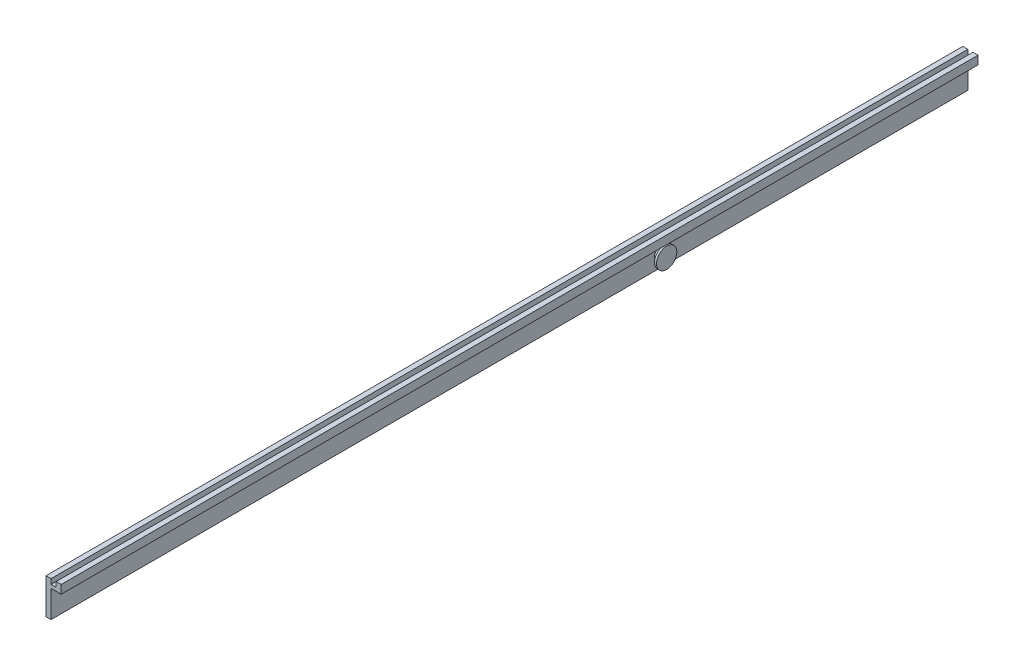
ISO-10303-21;
HEADER;
FILE_DESCRIPTION(('STEP AP214'),'2;1');
FILE_NAME('part.step','',(''),(''),'','','');
FILE_SCHEMA(('AUTOMOTIVE_DESIGN { 1 0 10303 214 1 1 1 1 }'));
ENDSEC;
DATA;
#1=APPLICATION_CONTEXT('core data for automotive mechanical design processes');
#2=APPLICATION_PROTOCOL_DEFINITION('international standard','automotive_design',2000,#1);
#3=PRODUCT_CONTEXT('',#1,'mechanical');
#4=PRODUCT('Part','Part','',(#3));
#5=PRODUCT_RELATED_PRODUCT_CATEGORY('part','',(#4));
#6=PRODUCT_DEFINITION_FORMATION('','',#4);
#7=PRODUCT_DEFINITION_CONTEXT('part definition',#1,'design');
#8=PRODUCT_DEFINITION('design','',#6,#7);
#9=PRODUCT_DEFINITION_SHAPE('','',#8);
#10=(LENGTH_UNIT() NAMED_UNIT(*) SI_UNIT(.MILLI.,.METRE.));
#11=(NAMED_UNIT(*) PLANE_ANGLE_UNIT() SI_UNIT($,.RADIAN.));
#12=(NAMED_UNIT(*) SI_UNIT($,.STERADIAN.) SOLID_ANGLE_UNIT());
#13=UNCERTAINTY_MEASURE_WITH_UNIT(LENGTH_MEASURE(1.E-05),#10,'distance_accuracy_value','');
#14=(GEOMETRIC_REPRESENTATION_CONTEXT(3) GLOBAL_UNCERTAINTY_ASSIGNED_CONTEXT((#13)) GLOBAL_UNIT_ASSIGNED_CONTEXT((#10,
#11,#12)) REPRESENTATION_CONTEXT('',''));
#15=CARTESIAN_POINT('',(0.,0.,0.));
#16=DIRECTION('',(0.,0.,1.));
#17=DIRECTION('',(1.,0.,0.));
#18=AXIS2_PLACEMENT_3D('',#15,#16,#17);
#19=CARTESIAN_POINT('',(20.,0.,904.));
#20=DIRECTION('',(0.,1.,0.));
#21=DIRECTION('',(0.,0.,1.));
#22=AXIS2_PLACEMENT_3D('',#19,#20,#21);
#23=PLANE('',#22);
#24=DIRECTION('',(0.,0.,1.));
#25=VECTOR('',#24,1.);
#26=CARTESIAN_POINT('',(10.,0.,0.));
#27=LINE('',#26,#25);
#28=CARTESIAN_POINT('',(10.,0.,0.));
#29=VERTEX_POINT('',#28);
#30=CARTESIAN_POINT('',(10.,0.,904.));
#31=VERTEX_POINT('',#30);
#32=EDGE_CURVE('E189',#29,#31,#27,.T.);
#33=ORIENTED_EDGE('',*,*,#32,.T.);
#34=DIRECTION('',(-1.,0.,0.));
#35=VECTOR('',#34,1.);
#36=CARTESIAN_POINT('',(20.,0.,904.));
#37=LINE('',#36,#35);
#38=CARTESIAN_POINT('',(5.,0.,904.));
#39=VERTEX_POINT('',#38);
#40=EDGE_CURVE('E187',#31,#39,#37,.T.);
#41=ORIENTED_EDGE('',*,*,#40,.T.);
#42=DIRECTION('',(0.,0.,-1.));
#43=VECTOR('',#42,1.);
#44=CARTESIAN_POINT('',(5.,0.,904.));
#45=LINE('',#44,#43);
#46=CARTESIAN_POINT('',(5.,0.,0.));
#47=VERTEX_POINT('',#46);
#48=EDGE_CURVE('E11',#39,#47,#45,.T.);
#49=ORIENTED_EDGE('',*,*,#48,.T.);
#50=DIRECTION('',(-1.,0.,0.));
#51=VECTOR('',#50,1.);
#52=CARTESIAN_POINT('',(20.,0.,0.));
#53=LINE('',#52,#51);
#54=EDGE_CURVE('E148',#29,#47,#53,.T.);
#55=ORIENTED_EDGE('',*,*,#54,.F.);
#56=EDGE_LOOP('',(#33,#41,#49,#55));
#57=FACE_BOUND('',#56,.T.);
#58=ADVANCED_FACE('F41',(#57),#23,.F.);
#59=CARTESIAN_POINT('',(20.,0.,904.));
#60=DIRECTION('',(-1.,0.,0.));
#61=DIRECTION('',(0.,0.,-1.));
#62=AXIS2_PLACEMENT_3D('',#59,#60,#61);
#63=PLANE('',#62);
#64=DIRECTION('',(0.,-1.,0.));
#65=VECTOR('',#64,1.);
#66=CARTESIAN_POINT('',(20.,0.,0.));
#67=LINE('',#66,#65);
#68=CARTESIAN_POINT('',(20.,35.,0.));
#69=VERTEX_POINT('',#68);
#70=CARTESIAN_POINT('',(20.,26.6744169741884,0.));
#71=VERTEX_POINT('',#70);
#72=EDGE_CURVE('E146',#69,#71,#67,.T.);
#73=ORIENTED_EDGE('',*,*,#72,.F.);
#74=DIRECTION('',(0.,0.,-1.));
#75=VECTOR('',#74,1.);
#76=CARTESIAN_POINT('',(20.,35.,904.));
#77=LINE('',#76,#75);
#78=CARTESIAN_POINT('',(20.,35.,904.));
#79=VERTEX_POINT('',#78);
#80=EDGE_CURVE('E145',#79,#69,#77,.T.);
#81=ORIENTED_EDGE('',*,*,#80,.F.);
#82=DIRECTION('',(0.,-1.,0.));
#83=VECTOR('',#82,1.);
#84=CARTESIAN_POINT('',(20.,0.,904.));
#85=LINE('',#84,#83);
#86=CARTESIAN_POINT('',(20.,26.6744169741884,904.));
#87=VERTEX_POINT('',#86);
#88=EDGE_CURVE('E165',#79,#87,#85,.T.);
#89=ORIENTED_EDGE('',*,*,#88,.T.);
#90=DIRECTION('',(0.,0.,-1.));
#91=VECTOR('',#90,1.);
#92=CARTESIAN_POINT('',(20.,26.6744169741884,0.));
#93=LINE('',#92,#91);
#94=EDGE_CURVE('E386',#87,#71,#93,.T.);
#95=ORIENTED_EDGE('',*,*,#94,.T.);
#96=EDGE_LOOP('',(#73,#81,#89,#95));
#97=FACE_BOUND('',#96,.T.);
#98=ADVANCED_FACE('F43',(#97),#63,.F.);
#99=CARTESIAN_POINT('',(5.,0.,904.));
#100=DIRECTION('',(1.,0.,0.));
#101=DIRECTION('',(0.,0.,1.));
#102=AXIS2_PLACEMENT_3D('',#99,#100,#101);
#103=PLANE('',#102);
#104=DIRECTION('',(0.,1.,0.));
#105=VECTOR('',#104,1.);
#106=CARTESIAN_POINT('',(5.,0.,0.));
#107=LINE('',#106,#105);
#108=CARTESIAN_POINT('',(5.,35.,0.));
#109=VERTEX_POINT('',#108);
#110=EDGE_CURVE('E152',#47,#109,#107,.T.);
#111=ORIENTED_EDGE('',*,*,#110,.F.);
#112=ORIENTED_EDGE('',*,*,#48,.F.);
#113=DIRECTION('',(0.,1.,0.));
#114=VECTOR('',#113,1.);
#115=CARTESIAN_POINT('',(5.,0.,904.));
#116=LINE('',#115,#114);
#117=CARTESIAN_POINT('',(5.,35.,904.));
#118=VERTEX_POINT('',#117);
#119=EDGE_CURVE('E103',#39,#118,#116,.T.);
#120=ORIENTED_EDGE('',*,*,#119,.T.);
#121=DIRECTION('',(0.,0.,-1.));
#122=VECTOR('',#121,1.);
#123=CARTESIAN_POINT('',(5.,35.,904.));
#124=LINE('',#123,#122);
#125=EDGE_CURVE('E49',#118,#109,#124,.T.);
#126=ORIENTED_EDGE('',*,*,#125,.T.);
#127=EDGE_LOOP('',(#111,#112,#120,#126));
#128=FACE_BOUND('',#127,.T.);
#129=ADVANCED_FACE('F174',(#128),#103,.F.);
#130=CARTESIAN_POINT('',(10.,35.,904.));
#131=DIRECTION('',(0.,-1.,0.));
#132=DIRECTION('',(0.,0.,-1.));
#133=AXIS2_PLACEMENT_3D('',#130,#131,#132);
#134=PLANE('',#133);
#135=DIRECTION('',(1.,0.,0.));
#136=VECTOR('',#135,1.);
#137=CARTESIAN_POINT('',(10.,35.,0.));
#138=LINE('',#137,#136);
#139=CARTESIAN_POINT('',(10.,35.,0.));
#140=VERTEX_POINT('',#139);
#141=EDGE_CURVE('E155',#109,#140,#138,.T.);
#142=ORIENTED_EDGE('',*,*,#141,.F.);
#143=ORIENTED_EDGE('',*,*,#125,.F.);
#144=DIRECTION('',(1.,0.,0.));
#145=VECTOR('',#144,1.);
#146=CARTESIAN_POINT('',(10.,35.,904.));
#147=LINE('',#146,#145);
#148=CARTESIAN_POINT('',(10.,35.,904.));
#149=VERTEX_POINT('',#148);
#150=EDGE_CURVE('E140',#118,#149,#147,.T.);
#151=ORIENTED_EDGE('',*,*,#150,.T.);
#152=DIRECTION('',(0.,0.,-1.));
#153=VECTOR('',#152,1.);
#154=CARTESIAN_POINT('',(10.,35.,904.));
#155=LINE('',#154,#153);
#156=EDGE_CURVE('E169',#149,#140,#155,.T.);
#157=ORIENTED_EDGE('',*,*,#156,.T.);
#158=EDGE_LOOP('',(#142,#143,#151,#157));
#159=FACE_BOUND('',#158,.T.);
#160=ADVANCED_FACE('F196',(#159),#134,.F.);
#161=CARTESIAN_POINT('',(10.,30.,904.));
#162=DIRECTION('',(-1.,0.,0.));
#163=DIRECTION('',(0.,0.,-1.));
#164=AXIS2_PLACEMENT_3D('',#161,#162,#163);
#165=PLANE('',#164);
#166=DIRECTION('',(0.,-1.,0.));
#167=VECTOR('',#166,1.);
#168=CARTESIAN_POINT('',(10.,30.,0.));
#169=LINE('',#168,#167);
#170=CARTESIAN_POINT('',(10.,30.,0.));
#171=VERTEX_POINT('',#170);
#172=EDGE_CURVE('E158',#140,#171,#169,.T.);
#173=ORIENTED_EDGE('',*,*,#172,.F.);
#174=ORIENTED_EDGE('',*,*,#156,.F.);
#175=DIRECTION('',(0.,-1.,0.));
#176=VECTOR('',#175,1.);
#177=CARTESIAN_POINT('',(10.,30.,904.));
#178=LINE('',#177,#176);
#179=CARTESIAN_POINT('',(10.,30.,904.));
#180=VERTEX_POINT('',#179);
#181=EDGE_CURVE('E138',#149,#180,#178,.T.);
#182=ORIENTED_EDGE('',*,*,#181,.T.);
#183=DIRECTION('',(0.,0.,-1.));
#184=VECTOR('',#183,1.);
#185=CARTESIAN_POINT('',(10.,30.,904.));
#186=LINE('',#185,#184);
#187=EDGE_CURVE('E132',#180,#171,#186,.T.);
#188=ORIENTED_EDGE('',*,*,#187,.T.);
#189=EDGE_LOOP('',(#173,#174,#182,#188));
#190=FACE_BOUND('',#189,.T.);
#191=ADVANCED_FACE('F199',(#190),#165,.F.);
#192=CARTESIAN_POINT('',(15.,30.,904.));
#193=DIRECTION('',(0.,-1.,0.));
#194=DIRECTION('',(0.,0.,-1.));
#195=AXIS2_PLACEMENT_3D('',#192,#193,#194);
#196=PLANE('',#195);
#197=DIRECTION('',(1.,0.,0.));
#198=VECTOR('',#197,1.);
#199=CARTESIAN_POINT('',(15.,30.,0.));
#200=LINE('',#199,#198);
#201=CARTESIAN_POINT('',(15.,30.,0.));
#202=VERTEX_POINT('',#201);
#203=EDGE_CURVE('E161',#171,#202,#200,.T.);
#204=ORIENTED_EDGE('',*,*,#203,.F.);
#205=ORIENTED_EDGE('',*,*,#187,.F.);
#206=DIRECTION('',(1.,0.,0.));
#207=VECTOR('',#206,1.);
#208=CARTESIAN_POINT('',(15.,30.,904.));
#209=LINE('',#208,#207);
#210=CARTESIAN_POINT('',(15.,30.,904.));
#211=VERTEX_POINT('',#210);
#212=EDGE_CURVE('E121',#180,#211,#209,.T.);
#213=ORIENTED_EDGE('',*,*,#212,.T.);
#214=DIRECTION('',(0.,0.,-1.));
#215=VECTOR('',#214,1.);
#216=CARTESIAN_POINT('',(15.,30.,904.));
#217=LINE('',#216,#215);
#218=EDGE_CURVE('E127',#211,#202,#217,.T.);
#219=ORIENTED_EDGE('',*,*,#218,.T.);
#220=EDGE_LOOP('',(#204,#205,#213,#219));
#221=FACE_BOUND('',#220,.T.);
#222=ADVANCED_FACE('F135',(#221),#196,.F.);
#223=CARTESIAN_POINT('',(15.,35.,904.));
#224=DIRECTION('',(1.,0.,0.));
#225=DIRECTION('',(0.,0.,1.));
#226=AXIS2_PLACEMENT_3D('',#223,#224,#225);
#227=PLANE('',#226);
#228=DIRECTION('',(0.,1.,0.));
#229=VECTOR('',#228,1.);
#230=CARTESIAN_POINT('',(15.,35.,0.));
#231=LINE('',#230,#229);
#232=CARTESIAN_POINT('',(15.,35.,0.));
#233=VERTEX_POINT('',#232);
#234=EDGE_CURVE('E129',#202,#233,#231,.T.);
#235=ORIENTED_EDGE('',*,*,#234,.F.);
#236=ORIENTED_EDGE('',*,*,#218,.F.);
#237=DIRECTION('',(0.,1.,0.));
#238=VECTOR('',#237,1.);
#239=CARTESIAN_POINT('',(15.,35.,904.));
#240=LINE('',#239,#238);
#241=CARTESIAN_POINT('',(15.,35.,904.));
#242=VERTEX_POINT('',#241);
#243=EDGE_CURVE('E117',#211,#242,#240,.T.);
#244=ORIENTED_EDGE('',*,*,#243,.T.);
#245=DIRECTION('',(0.,0.,-1.));
#246=VECTOR('',#245,1.);
#247=CARTESIAN_POINT('',(15.,35.,904.));
#248=LINE('',#247,#246);
#249=EDGE_CURVE('E133',#242,#233,#248,.T.);
#250=ORIENTED_EDGE('',*,*,#249,.T.);
#251=EDGE_LOOP('',(#235,#236,#244,#250));
#252=FACE_BOUND('',#251,.T.);
#253=ADVANCED_FACE('F128',(#252),#227,.F.);
#254=CARTESIAN_POINT('',(20.,35.,904.));
#255=DIRECTION('',(0.,-1.,0.));
#256=DIRECTION('',(0.,0.,-1.));
#257=AXIS2_PLACEMENT_3D('',#254,#255,#256);
#258=PLANE('',#257);
#259=DIRECTION('',(1.,0.,0.));
#260=VECTOR('',#259,1.);
#261=CARTESIAN_POINT('',(20.,35.,0.));
#262=LINE('',#261,#260);
#263=EDGE_CURVE('E95',#233,#69,#262,.T.);
#264=ORIENTED_EDGE('',*,*,#263,.F.);
#265=ORIENTED_EDGE('',*,*,#249,.F.);
#266=DIRECTION('',(1.,0.,0.));
#267=VECTOR('',#266,1.);
#268=CARTESIAN_POINT('',(20.,35.,904.));
#269=LINE('',#268,#267);
#270=EDGE_CURVE('E65',#242,#79,#269,.T.);
#271=ORIENTED_EDGE('',*,*,#270,.T.);
#272=ORIENTED_EDGE('',*,*,#80,.T.);
#273=EDGE_LOOP('',(#264,#265,#271,#272));
#274=FACE_BOUND('',#273,.T.);
#275=ADVANCED_FACE('F245',(#274),#258,.F.);
#276=CARTESIAN_POINT('',(20.,0.,904.));
#277=DIRECTION('',(0.,0.,-1.));
#278=DIRECTION('',(1.,0.,0.));
#279=AXIS2_PLACEMENT_3D('',#276,#277,#278);
#280=PLANE('',#279);
#281=ORIENTED_EDGE('',*,*,#88,.F.);
#282=ORIENTED_EDGE('',*,*,#270,.F.);
#283=ORIENTED_EDGE('',*,*,#243,.F.);
#284=ORIENTED_EDGE('',*,*,#212,.F.);
#285=ORIENTED_EDGE('',*,*,#181,.F.);
#286=ORIENTED_EDGE('',*,*,#150,.F.);
#287=ORIENTED_EDGE('',*,*,#119,.F.);
#288=ORIENTED_EDGE('',*,*,#40,.F.);
#289=DIRECTION('',(0.,1.,0.));
#290=VECTOR('',#289,1.);
#291=CARTESIAN_POINT('',(10.,26.6744169741884,904.));
#292=LINE('',#291,#290);
#293=CARTESIAN_POINT('',(10.,26.6744169741884,904.));
#294=VERTEX_POINT('',#293);
#295=EDGE_CURVE('E391',#31,#294,#292,.T.);
#296=ORIENTED_EDGE('',*,*,#295,.T.);
#297=DIRECTION('',(1.,0.,0.));
#298=VECTOR('',#297,1.);
#299=CARTESIAN_POINT('',(10.,26.6744169741884,904.));
#300=LINE('',#299,#298);
#301=EDGE_CURVE('E394',#294,#87,#300,.T.);
#302=ORIENTED_EDGE('',*,*,#301,.T.);
#303=EDGE_LOOP('',(#281,#282,#283,#284,#285,#286,#287,#288,#296,#302));
#304=FACE_BOUND('',#303,.T.);
#305=ADVANCED_FACE('F119',(#304),#280,.F.);
#306=CARTESIAN_POINT('',(20.,0.,0.));
#307=DIRECTION('',(0.,0.,-1.));
#308=DIRECTION('',(1.,0.,0.));
#309=AXIS2_PLACEMENT_3D('',#306,#307,#308);
#310=PLANE('',#309);
#311=DIRECTION('',(1.,0.,0.));
#312=VECTOR('',#311,1.);
#313=CARTESIAN_POINT('',(10.,26.6744169741884,0.));
#314=LINE('',#313,#312);
#315=CARTESIAN_POINT('',(10.,26.6744169741884,0.));
#316=VERTEX_POINT('',#315);
#317=EDGE_CURVE('E149',#316,#71,#314,.T.);
#318=ORIENTED_EDGE('',*,*,#317,.F.);
#319=DIRECTION('',(0.,-1.,0.));
#320=VECTOR('',#319,1.);
#321=CARTESIAN_POINT('',(10.,26.6744169741884,0.));
#322=LINE('',#321,#320);
#323=EDGE_CURVE('E182',#316,#29,#322,.T.);
#324=ORIENTED_EDGE('',*,*,#323,.T.);
#325=ORIENTED_EDGE('',*,*,#54,.T.);
#326=ORIENTED_EDGE('',*,*,#110,.T.);
#327=ORIENTED_EDGE('',*,*,#141,.T.);
#328=ORIENTED_EDGE('',*,*,#172,.T.);
#329=ORIENTED_EDGE('',*,*,#203,.T.);
#330=ORIENTED_EDGE('',*,*,#234,.T.);
#331=ORIENTED_EDGE('',*,*,#263,.T.);
#332=ORIENTED_EDGE('',*,*,#72,.T.);
#333=EDGE_LOOP('',(#318,#324,#325,#326,#327,#328,#329,#330,#331,#332));
#334=FACE_BOUND('',#333,.T.);
#335=ADVANCED_FACE('F178',(#334),#310,.T.);
#336=CARTESIAN_POINT('',(10.,26.6744169741884,0.));
#337=DIRECTION('',(0.,1.,0.));
#338=DIRECTION('',(0.,0.,1.));
#339=AXIS2_PLACEMENT_3D('',#336,#337,#338);
#340=PLANE('',#339);
#341=ORIENTED_EDGE('',*,*,#94,.F.);
#342=ORIENTED_EDGE('',*,*,#301,.F.);
#343=DIRECTION('',(0.,0.,-1.));
#344=VECTOR('',#343,1.);
#345=CARTESIAN_POINT('',(10.,26.6744169741884,0.));
#346=LINE('',#345,#344);
#347=EDGE_CURVE('E56',#294,#316,#346,.T.);
#348=ORIENTED_EDGE('',*,*,#347,.T.);
#349=ORIENTED_EDGE('',*,*,#317,.T.);
#350=EDGE_LOOP('',(#341,#342,#348,#349));
#351=FACE_BOUND('',#350,.T.);
#352=ADVANCED_FACE('F273',(#351),#340,.F.);
#353=CARTESIAN_POINT('',(10.,0.,0.));
#354=DIRECTION('',(1.,0.,0.));
#355=DIRECTION('',(0.,0.,1.));
#356=AXIS2_PLACEMENT_3D('',#353,#354,#355);
#357=PLANE('',#356);
#358=CARTESIAN_POINT('',(10.,12.5,304.));
#359=DIRECTION('',(-1.,0.,0.));
#360=DIRECTION('',(0.,0.,1.));
#361=AXIS2_PLACEMENT_3D('',#358,#359,#360);
#362=CIRCLE('',#361,4.99999999999999);
#363=CARTESIAN_POINT('',(10.,12.5,309.));
#364=VERTEX_POINT('',#363);
#365=EDGE_CURVE('E382',#364,#364,#362,.T.);
#366=ORIENTED_EDGE('',*,*,#365,.T.);
#367=EDGE_LOOP('',(#366));
#368=FACE_BOUND('',#367,.T.);
#369=ORIENTED_EDGE('',*,*,#323,.F.);
#370=ORIENTED_EDGE('',*,*,#347,.F.);
#371=ORIENTED_EDGE('',*,*,#295,.F.);
#372=ORIENTED_EDGE('',*,*,#32,.F.);
#373=EDGE_LOOP('',(#369,#370,#371,#372));
#374=FACE_BOUND('',#373,.T.);
#375=ADVANCED_FACE('F283',(#368,#374),#357,.T.);
#376=CARTESIAN_POINT('',(15.,12.5,304.));
#377=DIRECTION('',(-1.,0.,0.));
#378=DIRECTION('',(0.,0.,-1.));
#379=AXIS2_PLACEMENT_3D('',#376,#377,#378);
#380=CYLINDRICAL_SURFACE('',#379,4.99999999999999);
#381=CARTESIAN_POINT('',(15.,12.5,304.));
#382=DIRECTION('',(-1.,0.,0.));
#383=DIRECTION('',(0.,0.,1.));
#384=AXIS2_PLACEMENT_3D('',#381,#382,#383);
#385=CIRCLE('',#384,4.99999999999999);
#386=CARTESIAN_POINT('',(15.,12.5,309.));
#387=VERTEX_POINT('',#386);
#388=EDGE_CURVE('E374',#387,#387,#385,.T.);
#389=ORIENTED_EDGE('',*,*,#388,.T.);
#390=EDGE_LOOP('',(#389));
#391=FACE_BOUND('',#390,.T.);
#392=ORIENTED_EDGE('',*,*,#365,.F.);
#393=EDGE_LOOP('',(#392));
#394=FACE_BOUND('',#393,.T.);
#395=ADVANCED_FACE('F293',(#391,#394),#380,.T.);
#396=CARTESIAN_POINT('',(17.,12.5,304.));
#397=DIRECTION('',(-1.,0.,0.));
#398=DIRECTION('',(0.,0.,-1.));
#399=AXIS2_PLACEMENT_3D('',#396,#397,#398);
#400=CYLINDRICAL_SURFACE('',#399,9.99999999999998);
#401=CARTESIAN_POINT('',(17.,12.5,304.));
#402=DIRECTION('',(-1.,0.,0.));
#403=DIRECTION('',(0.,0.,1.));
#404=AXIS2_PLACEMENT_3D('',#401,#402,#403);
#405=CIRCLE('',#404,9.99999999999998);
#406=CARTESIAN_POINT('',(17.,12.5,314.));
#407=VERTEX_POINT('',#406);
#408=EDGE_CURVE('E379',#407,#407,#405,.T.);
#409=ORIENTED_EDGE('',*,*,#408,.T.);
#410=EDGE_LOOP('',(#409));
#411=FACE_BOUND('',#410,.T.);
#412=CARTESIAN_POINT('',(15.,12.5,304.));
#413=DIRECTION('',(-1.,0.,0.));
#414=DIRECTION('',(0.,0.,1.));
#415=AXIS2_PLACEMENT_3D('',#412,#413,#414);
#416=CIRCLE('',#415,9.99999999999998);
#417=CARTESIAN_POINT('',(15.,12.5,314.));
#418=VERTEX_POINT('',#417);
#419=EDGE_CURVE('E377',#418,#418,#416,.T.);
#420=ORIENTED_EDGE('',*,*,#419,.F.);
#421=EDGE_LOOP('',(#420));
#422=FACE_BOUND('',#421,.T.);
#423=ADVANCED_FACE('F304',(#411,#422),#400,.T.);
#424=CARTESIAN_POINT('',(17.,12.5,304.));
#425=DIRECTION('',(1.,0.,0.));
#426=DIRECTION('',(0.,0.,1.));
#427=AXIS2_PLACEMENT_3D('',#424,#425,#426);
#428=PLANE('',#427);
#429=ORIENTED_EDGE('',*,*,#408,.F.);
#430=EDGE_LOOP('',(#429));
#431=FACE_BOUND('',#430,.T.);
#432=ADVANCED_FACE('F315',(#431),#428,.T.);
#433=CARTESIAN_POINT('',(15.,12.5,304.));
#434=DIRECTION('',(1.,0.,0.));
#435=DIRECTION('',(0.,0.,1.));
#436=AXIS2_PLACEMENT_3D('',#433,#434,#435);
#437=PLANE('',#436);
#438=ORIENTED_EDGE('',*,*,#388,.F.);
#439=EDGE_LOOP('',(#438));
#440=FACE_BOUND('',#439,.T.);
#441=ORIENTED_EDGE('',*,*,#419,.T.);
#442=EDGE_LOOP('',(#441));
#443=FACE_BOUND('',#442,.T.);
#444=ADVANCED_FACE('F326',(#440,#443),#437,.F.);
#445=CLOSED_SHELL('',(#58,#98,#129,#160,#191,#222,#253,#275,#305,#335,#352,#375,#395,#423,#432,#444));
#446=MANIFOLD_SOLID_BREP('B2',#445);
#447=ADVANCED_BREP_SHAPE_REPRESENTATION('',(#18,#446),#14);
#448=SHAPE_DEFINITION_REPRESENTATION(#9,#447);
ENDSEC;
END-ISO-10303-21;
